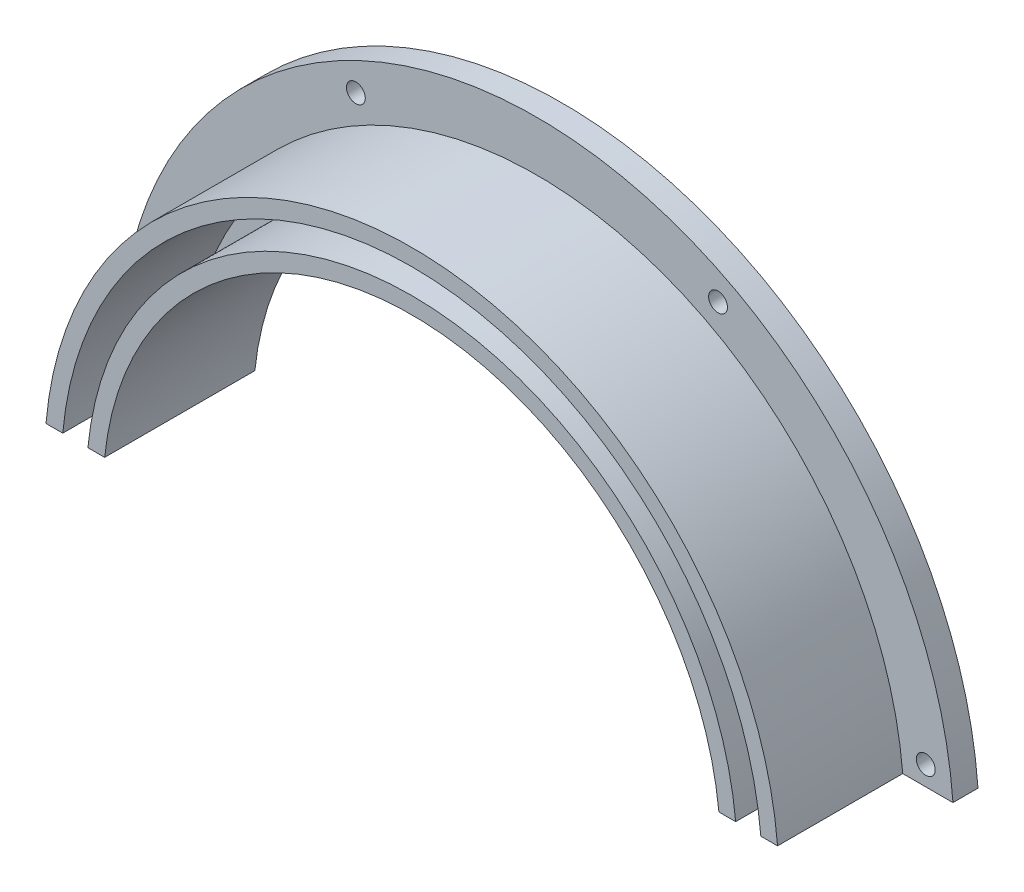
ISO-10303-21;
HEADER;
FILE_DESCRIPTION(('STEP AP214'),'2;1');
FILE_NAME('part.step','',(''),(''),'','','');
FILE_SCHEMA(('AUTOMOTIVE_DESIGN { 1 0 10303 214 1 1 1 1 }'));
ENDSEC;
DATA;
#1=APPLICATION_CONTEXT('core data for automotive mechanical design processes');
#2=APPLICATION_PROTOCOL_DEFINITION('international standard','automotive_design',2000,#1);
#3=PRODUCT_CONTEXT('',#1,'mechanical');
#4=PRODUCT('Part','Part','',(#3));
#5=PRODUCT_RELATED_PRODUCT_CATEGORY('part','',(#4));
#6=PRODUCT_DEFINITION_FORMATION('','',#4);
#7=PRODUCT_DEFINITION_CONTEXT('part definition',#1,'design');
#8=PRODUCT_DEFINITION('design','',#6,#7);
#9=PRODUCT_DEFINITION_SHAPE('','',#8);
#10=(LENGTH_UNIT() NAMED_UNIT(*) SI_UNIT(.MILLI.,.METRE.));
#11=(NAMED_UNIT(*) PLANE_ANGLE_UNIT() SI_UNIT($,.RADIAN.));
#12=(NAMED_UNIT(*) SI_UNIT($,.STERADIAN.) SOLID_ANGLE_UNIT());
#13=UNCERTAINTY_MEASURE_WITH_UNIT(LENGTH_MEASURE(1.E-05),#10,'distance_accuracy_value','');
#14=(GEOMETRIC_REPRESENTATION_CONTEXT(3) GLOBAL_UNCERTAINTY_ASSIGNED_CONTEXT((#13)) GLOBAL_UNIT_ASSIGNED_CONTEXT((#10,
#11,#12)) REPRESENTATION_CONTEXT('',''));
#15=CARTESIAN_POINT('',(0.,0.,0.));
#16=DIRECTION('',(0.,0.,1.));
#17=DIRECTION('',(1.,0.,0.));
#18=AXIS2_PLACEMENT_3D('',#15,#16,#17);
#19=CARTESIAN_POINT('',(-50.,-1.74574066942157E-13,0.));
#20=DIRECTION('',(0.,0.,-1.));
#21=DIRECTION('',(0.,1.,0.));
#22=AXIS2_PLACEMENT_3D('',#19,#20,#21);
#23=PLANE('',#22);
#24=CARTESIAN_POINT('',(-46.5979084845691,6.13473103434212,0.));
#25=DIRECTION('',(0.,0.,-1.));
#26=DIRECTION('',(0.,1.,0.));
#27=AXIS2_PLACEMENT_3D('',#24,#25,#26);
#28=CIRCLE('',#27,2.0574);
#29=CARTESIAN_POINT('',(-46.5979084845691,8.19213103434212,0.));
#30=VERTEX_POINT('',#29);
#31=EDGE_CURVE('E308',#30,#30,#28,.T.);
#32=ORIENTED_EDGE('',*,*,#31,.F.);
#33=EDGE_LOOP('',(#32));
#34=FACE_BOUND('',#33,.T.);
#35=CARTESIAN_POINT('',(-21.7021848220468,41.6895091593763,0.));
#36=DIRECTION('',(0.,0.,-1.));
#37=DIRECTION('',(0.,1.,0.));
#38=AXIS2_PLACEMENT_3D('',#35,#36,#37);
#39=CIRCLE('',#38,2.0574);
#40=CARTESIAN_POINT('',(-21.7021848220468,43.7469091593763,0.));
#41=VERTEX_POINT('',#40);
#42=EDGE_CURVE('E178',#41,#41,#39,.T.);
#43=ORIENTED_EDGE('',*,*,#42,.F.);
#44=EDGE_LOOP('',(#43));
#45=FACE_BOUND('',#44,.T.);
#46=CARTESIAN_POINT('',(21.7021848220465,41.6895091593765,0.));
#47=DIRECTION('',(0.,0.,-1.));
#48=DIRECTION('',(0.,1.,0.));
#49=AXIS2_PLACEMENT_3D('',#46,#47,#48);
#50=CIRCLE('',#49,2.0574);
#51=CARTESIAN_POINT('',(21.7021848220465,43.7469091593765,0.));
#52=VERTEX_POINT('',#51);
#53=EDGE_CURVE('E171',#52,#52,#50,.T.);
#54=ORIENTED_EDGE('',*,*,#53,.F.);
#55=EDGE_LOOP('',(#54));
#56=FACE_BOUND('',#55,.T.);
#57=CARTESIAN_POINT('',(46.5979084845691,6.13473103434243,0.));
#58=DIRECTION('',(0.,0.,-1.));
#59=DIRECTION('',(0.,1.,0.));
#60=AXIS2_PLACEMENT_3D('',#57,#58,#59);
#61=CIRCLE('',#60,2.0574);
#62=CARTESIAN_POINT('',(46.5979084845691,8.19213103434243,0.));
#63=VERTEX_POINT('',#62);
#64=EDGE_CURVE('E167',#63,#63,#61,.T.);
#65=ORIENTED_EDGE('',*,*,#64,.F.);
#66=EDGE_LOOP('',(#65));
#67=FACE_BOUND('',#66,.T.);
#68=DIRECTION('',(1.,0.,0.));
#69=VECTOR('',#68,1.);
#70=CARTESIAN_POINT('',(81.0364783019644,3.79999999999997,0.));
#71=LINE('',#70,#69);
#72=CARTESIAN_POINT('',(-49.85539088203,3.8,0.));
#73=VERTEX_POINT('',#72);
#74=CARTESIAN_POINT('',(-36.804347569275,3.79999999999999,0.));
#75=VERTEX_POINT('',#74);
#76=EDGE_CURVE('E115',#73,#75,#71,.T.);
#77=ORIENTED_EDGE('',*,*,#76,.F.);
#78=CARTESIAN_POINT('',(0.,0.,0.));
#79=DIRECTION('',(0.,0.,-1.));
#80=DIRECTION('',(0.,1.,0.));
#81=AXIS2_PLACEMENT_3D('',#78,#79,#80);
#82=CIRCLE('',#81,50.);
#83=CARTESIAN_POINT('',(49.85539088203,3.79999999999998,0.));
#84=VERTEX_POINT('',#83);
#85=EDGE_CURVE('E126',#73,#84,#82,.T.);
#86=ORIENTED_EDGE('',*,*,#85,.T.);
#87=CARTESIAN_POINT('',(36.804347569275,3.79999999999998,0.));
#88=VERTEX_POINT('',#87);
#89=EDGE_CURVE('E54',#88,#84,#71,.T.);
#90=ORIENTED_EDGE('',*,*,#89,.F.);
#91=CARTESIAN_POINT('',(0.,0.,0.));
#92=DIRECTION('',(0.,0.,-1.));
#93=DIRECTION('',(0.,1.,0.));
#94=AXIS2_PLACEMENT_3D('',#91,#92,#93);
#95=CIRCLE('',#94,37.);
#96=EDGE_CURVE('E121',#75,#88,#95,.T.);
#97=ORIENTED_EDGE('',*,*,#96,.F.);
#98=EDGE_LOOP('',(#77,#86,#90,#97));
#99=FACE_BOUND('',#98,.T.);
#100=ADVANCED_FACE('F38',(#34,#45,#56,#67,#99),#23,.T.);
#101=CARTESIAN_POINT('',(0.,0.,0.));
#102=DIRECTION('',(0.,0.,-1.));
#103=DIRECTION('',(0.,1.,0.));
#104=AXIS2_PLACEMENT_3D('',#101,#102,#103);
#105=CYLINDRICAL_SURFACE('',#104,37.);
#106=DIRECTION('',(0.,0.,-1.));
#107=VECTOR('',#106,1.);
#108=CARTESIAN_POINT('',(36.804347569275,3.79999999999998,0.));
#109=LINE('',#108,#107);
#110=CARTESIAN_POINT('',(36.804347569275,3.79999999999998,18.));
#111=VERTEX_POINT('',#110);
#112=EDGE_CURVE('E132',#111,#88,#109,.T.);
#113=ORIENTED_EDGE('',*,*,#112,.F.);
#114=CARTESIAN_POINT('',(0.,0.,18.));
#115=DIRECTION('',(0.,0.,-1.));
#116=DIRECTION('',(0.,1.,0.));
#117=AXIS2_PLACEMENT_3D('',#114,#115,#116);
#118=CIRCLE('',#117,37.);
#119=CARTESIAN_POINT('',(-36.804347569275,3.79999999999999,18.));
#120=VERTEX_POINT('',#119);
#121=EDGE_CURVE('E157',#120,#111,#118,.T.);
#122=ORIENTED_EDGE('',*,*,#121,.F.);
#123=DIRECTION('',(0.,0.,-1.));
#124=VECTOR('',#123,1.);
#125=CARTESIAN_POINT('',(-36.804347569275,3.79999999999999,0.));
#126=LINE('',#125,#124);
#127=EDGE_CURVE('E136',#75,#120,#126,.F.);
#128=ORIENTED_EDGE('',*,*,#127,.F.);
#129=ORIENTED_EDGE('',*,*,#96,.T.);
#130=EDGE_LOOP('',(#113,#122,#128,#129));
#131=FACE_BOUND('',#130,.T.);
#132=ADVANCED_FACE('F40',(#131),#105,.F.);
#133=CARTESIAN_POINT('',(-37.,-1.31389173775661E-13,18.));
#134=DIRECTION('',(0.,0.,1.));
#135=DIRECTION('',(0.,-1.,0.));
#136=AXIS2_PLACEMENT_3D('',#133,#134,#135);
#137=PLANE('',#136);
#138=DIRECTION('',(1.,0.,0.));
#139=VECTOR('',#138,1.);
#140=CARTESIAN_POINT('',(81.0364783019644,3.79999999999997,18.));
#141=LINE('',#140,#139);
#142=CARTESIAN_POINT('',(38.8144303062662,3.79999999999998,18.));
#143=VERTEX_POINT('',#142);
#144=EDGE_CURVE('E193',#111,#143,#141,.T.);
#145=ORIENTED_EDGE('',*,*,#144,.T.);
#146=CARTESIAN_POINT('',(0.,0.,18.));
#147=DIRECTION('',(0.,0.,-1.));
#148=DIRECTION('',(0.,1.,0.));
#149=AXIS2_PLACEMENT_3D('',#146,#147,#148);
#150=CIRCLE('',#149,39.);
#151=CARTESIAN_POINT('',(-38.8144303062662,3.79999999999999,18.));
#152=VERTEX_POINT('',#151);
#153=EDGE_CURVE('E154',#152,#143,#150,.T.);
#154=ORIENTED_EDGE('',*,*,#153,.F.);
#155=EDGE_CURVE('E213',#152,#120,#141,.T.);
#156=ORIENTED_EDGE('',*,*,#155,.T.);
#157=ORIENTED_EDGE('',*,*,#121,.T.);
#158=EDGE_LOOP('',(#145,#154,#156,#157));
#159=FACE_BOUND('',#158,.T.);
#160=ADVANCED_FACE('F220',(#159),#137,.T.);
#161=CARTESIAN_POINT('',(0.,0.,0.));
#162=DIRECTION('',(0.,0.,-1.));
#163=DIRECTION('',(0.,1.,0.));
#164=AXIS2_PLACEMENT_3D('',#161,#162,#163);
#165=CYLINDRICAL_SURFACE('',#164,39.);
#166=DIRECTION('',(0.,0.,-1.));
#167=VECTOR('',#166,1.);
#168=CARTESIAN_POINT('',(38.8144303062662,3.79999999999998,0.));
#169=LINE('',#168,#167);
#170=CARTESIAN_POINT('',(38.8144303062662,3.79999999999998,3.));
#171=VERTEX_POINT('',#170);
#172=EDGE_CURVE('E211',#171,#143,#169,.F.);
#173=ORIENTED_EDGE('',*,*,#172,.F.);
#174=CARTESIAN_POINT('',(0.,0.,3.));
#175=DIRECTION('',(0.,0.,-1.));
#176=DIRECTION('',(0.,1.,0.));
#177=AXIS2_PLACEMENT_3D('',#174,#175,#176);
#178=CIRCLE('',#177,39.);
#179=CARTESIAN_POINT('',(-38.8144303062662,3.79999999999999,3.));
#180=VERTEX_POINT('',#179);
#181=EDGE_CURVE('E151',#180,#171,#178,.T.);
#182=ORIENTED_EDGE('',*,*,#181,.F.);
#183=DIRECTION('',(0.,0.,-1.));
#184=VECTOR('',#183,1.);
#185=CARTESIAN_POINT('',(-38.8144303062662,3.79999999999999,0.));
#186=LINE('',#185,#184);
#187=EDGE_CURVE('E206',#152,#180,#186,.T.);
#188=ORIENTED_EDGE('',*,*,#187,.F.);
#189=ORIENTED_EDGE('',*,*,#153,.T.);
#190=EDGE_LOOP('',(#173,#182,#188,#189));
#191=FACE_BOUND('',#190,.T.);
#192=ADVANCED_FACE('F225',(#191),#165,.T.);
#193=CARTESIAN_POINT('',(-39.,-1.36535166254626E-13,3.));
#194=DIRECTION('',(0.,0.,1.));
#195=DIRECTION('',(0.,-1.,0.));
#196=AXIS2_PLACEMENT_3D('',#193,#194,#195);
#197=PLANE('',#196);
#198=DIRECTION('',(-1.,0.,0.));
#199=VECTOR('',#198,1.);
#200=CARTESIAN_POINT('',(-39.,3.79999999999999,3.));
#201=LINE('',#200,#199);
#202=CARTESIAN_POINT('',(41.8277419902151,3.79999999999998,3.));
#203=VERTEX_POINT('',#202);
#204=EDGE_CURVE('E207',#203,#171,#201,.T.);
#205=ORIENTED_EDGE('',*,*,#204,.F.);
#206=CARTESIAN_POINT('',(0.,0.,3.));
#207=DIRECTION('',(0.,0.,-1.));
#208=DIRECTION('',(0.,1.,0.));
#209=AXIS2_PLACEMENT_3D('',#206,#207,#208);
#210=CIRCLE('',#209,42.);
#211=CARTESIAN_POINT('',(-41.8277419902151,3.79999999999999,3.));
#212=VERTEX_POINT('',#211);
#213=EDGE_CURVE('E148',#212,#203,#210,.T.);
#214=ORIENTED_EDGE('',*,*,#213,.F.);
#215=EDGE_CURVE('E204',#180,#212,#201,.T.);
#216=ORIENTED_EDGE('',*,*,#215,.F.);
#217=ORIENTED_EDGE('',*,*,#181,.T.);
#218=EDGE_LOOP('',(#205,#214,#216,#217));
#219=FACE_BOUND('',#218,.T.);
#220=ADVANCED_FACE('F232',(#219),#197,.T.);
#221=CARTESIAN_POINT('',(0.,0.,0.));
#222=DIRECTION('',(0.,0.,-1.));
#223=DIRECTION('',(0.,1.,0.));
#224=AXIS2_PLACEMENT_3D('',#221,#222,#223);
#225=CYLINDRICAL_SURFACE('',#224,42.);
#226=DIRECTION('',(0.,0.,-1.));
#227=VECTOR('',#226,1.);
#228=CARTESIAN_POINT('',(41.8277419902151,3.79999999999998,0.));
#229=LINE('',#228,#227);
#230=CARTESIAN_POINT('',(41.8277419902151,3.79999999999998,18.));
#231=VERTEX_POINT('',#230);
#232=EDGE_CURVE('E209',#231,#203,#229,.T.);
#233=ORIENTED_EDGE('',*,*,#232,.F.);
#234=CARTESIAN_POINT('',(0.,0.,18.));
#235=DIRECTION('',(0.,0.,-1.));
#236=DIRECTION('',(0.,1.,0.));
#237=AXIS2_PLACEMENT_3D('',#234,#235,#236);
#238=CIRCLE('',#237,42.);
#239=CARTESIAN_POINT('',(-41.8277419902151,3.79999999999999,18.));
#240=VERTEX_POINT('',#239);
#241=EDGE_CURVE('E145',#240,#231,#238,.T.);
#242=ORIENTED_EDGE('',*,*,#241,.F.);
#243=DIRECTION('',(0.,0.,-1.));
#244=VECTOR('',#243,1.);
#245=CARTESIAN_POINT('',(-41.8277419902151,3.79999999999999,0.));
#246=LINE('',#245,#244);
#247=EDGE_CURVE('E202',#212,#240,#246,.F.);
#248=ORIENTED_EDGE('',*,*,#247,.F.);
#249=ORIENTED_EDGE('',*,*,#213,.T.);
#250=EDGE_LOOP('',(#233,#242,#248,#249));
#251=FACE_BOUND('',#250,.T.);
#252=ADVANCED_FACE('F235',(#251),#225,.F.);
#253=CARTESIAN_POINT('',(-42.,-1.48846580469877E-13,18.));
#254=DIRECTION('',(0.,0.,1.));
#255=DIRECTION('',(0.,-1.,0.));
#256=AXIS2_PLACEMENT_3D('',#253,#254,#255);
#257=PLANE('',#256);
#258=CARTESIAN_POINT('',(43.8356019691757,3.79999999999998,18.));
#259=VERTEX_POINT('',#258);
#260=EDGE_CURVE('E128',#231,#259,#141,.T.);
#261=ORIENTED_EDGE('',*,*,#260,.T.);
#262=CARTESIAN_POINT('',(0.,0.,18.));
#263=DIRECTION('',(0.,0.,-1.));
#264=DIRECTION('',(0.,1.,0.));
#265=AXIS2_PLACEMENT_3D('',#262,#263,#264);
#266=CIRCLE('',#265,44.);
#267=CARTESIAN_POINT('',(-43.8356019691757,3.79999999999999,18.));
#268=VERTEX_POINT('',#267);
#269=EDGE_CURVE('E142',#268,#259,#266,.T.);
#270=ORIENTED_EDGE('',*,*,#269,.F.);
#271=EDGE_CURVE('E194',#268,#240,#141,.T.);
#272=ORIENTED_EDGE('',*,*,#271,.T.);
#273=ORIENTED_EDGE('',*,*,#241,.T.);
#274=EDGE_LOOP('',(#261,#270,#272,#273));
#275=FACE_BOUND('',#274,.T.);
#276=ADVANCED_FACE('F241',(#275),#257,.T.);
#277=CARTESIAN_POINT('',(0.,0.,0.));
#278=DIRECTION('',(0.,0.,-1.));
#279=DIRECTION('',(0.,1.,0.));
#280=AXIS2_PLACEMENT_3D('',#277,#278,#279);
#281=CYLINDRICAL_SURFACE('',#280,44.);
#282=DIRECTION('',(0.,0.,-1.));
#283=VECTOR('',#282,1.);
#284=CARTESIAN_POINT('',(43.8356019691757,3.79999999999998,0.));
#285=LINE('',#284,#283);
#286=CARTESIAN_POINT('',(43.8356019691757,3.79999999999998,3.));
#287=VERTEX_POINT('',#286);
#288=EDGE_CURVE('E200',#287,#259,#285,.F.);
#289=ORIENTED_EDGE('',*,*,#288,.F.);
#290=CARTESIAN_POINT('',(0.,0.,3.));
#291=DIRECTION('',(0.,0.,-1.));
#292=DIRECTION('',(0.,1.,0.));
#293=AXIS2_PLACEMENT_3D('',#290,#291,#292);
#294=CIRCLE('',#293,44.);
#295=CARTESIAN_POINT('',(-43.8356019691757,3.79999999999999,3.));
#296=VERTEX_POINT('',#295);
#297=EDGE_CURVE('E134',#296,#287,#294,.T.);
#298=ORIENTED_EDGE('',*,*,#297,.F.);
#299=DIRECTION('',(0.,0.,-1.));
#300=VECTOR('',#299,1.);
#301=CARTESIAN_POINT('',(-43.8356019691757,3.79999999999999,0.));
#302=LINE('',#301,#300);
#303=EDGE_CURVE('E197',#268,#296,#302,.T.);
#304=ORIENTED_EDGE('',*,*,#303,.F.);
#305=ORIENTED_EDGE('',*,*,#269,.T.);
#306=EDGE_LOOP('',(#289,#298,#304,#305));
#307=FACE_BOUND('',#306,.T.);
#308=ADVANCED_FACE('F244',(#307),#281,.T.);
#309=CARTESIAN_POINT('',(-44.,-1.53992572948842E-13,3.));
#310=DIRECTION('',(0.,0.,1.));
#311=DIRECTION('',(0.,-1.,0.));
#312=AXIS2_PLACEMENT_3D('',#309,#310,#311);
#313=PLANE('',#312);
#314=CARTESIAN_POINT('',(-46.5979084845691,6.13473103434212,3.));
#315=DIRECTION('',(0.,0.,1.));
#316=DIRECTION('',(0.,-1.,0.));
#317=AXIS2_PLACEMENT_3D('',#314,#315,#316);
#318=CIRCLE('',#317,1.1303);
#319=CARTESIAN_POINT('',(-46.5979084845691,5.00443103434212,3.));
#320=VERTEX_POINT('',#319);
#321=EDGE_CURVE('E42',#320,#320,#318,.T.);
#322=ORIENTED_EDGE('',*,*,#321,.F.);
#323=EDGE_LOOP('',(#322));
#324=FACE_BOUND('',#323,.T.);
#325=CARTESIAN_POINT('',(-21.7021848220468,41.6895091593763,3.00000000000001));
#326=DIRECTION('',(0.,0.,1.));
#327=DIRECTION('',(0.,-1.,0.));
#328=AXIS2_PLACEMENT_3D('',#325,#326,#327);
#329=CIRCLE('',#328,1.1303);
#330=CARTESIAN_POINT('',(-21.7021848220468,40.5592091593763,3.00000000000001));
#331=VERTEX_POINT('',#330);
#332=EDGE_CURVE('E169',#331,#331,#329,.T.);
#333=ORIENTED_EDGE('',*,*,#332,.F.);
#334=EDGE_LOOP('',(#333));
#335=FACE_BOUND('',#334,.T.);
#336=CARTESIAN_POINT('',(21.7021848220465,41.6895091593765,3.00000000000001));
#337=DIRECTION('',(0.,0.,1.));
#338=DIRECTION('',(0.,-1.,0.));
#339=AXIS2_PLACEMENT_3D('',#336,#337,#338);
#340=CIRCLE('',#339,1.1303);
#341=CARTESIAN_POINT('',(21.7021848220465,40.5592091593765,3.00000000000001));
#342=VERTEX_POINT('',#341);
#343=EDGE_CURVE('E165',#342,#342,#340,.T.);
#344=ORIENTED_EDGE('',*,*,#343,.F.);
#345=EDGE_LOOP('',(#344));
#346=FACE_BOUND('',#345,.T.);
#347=CARTESIAN_POINT('',(46.5979084845691,6.13473103434243,3.));
#348=DIRECTION('',(0.,0.,1.));
#349=DIRECTION('',(0.,-1.,0.));
#350=AXIS2_PLACEMENT_3D('',#347,#348,#349);
#351=CIRCLE('',#350,1.1303);
#352=CARTESIAN_POINT('',(46.5979084845691,5.00443103434244,3.));
#353=VERTEX_POINT('',#352);
#354=EDGE_CURVE('E161',#353,#353,#351,.T.);
#355=ORIENTED_EDGE('',*,*,#354,.F.);
#356=EDGE_LOOP('',(#355));
#357=FACE_BOUND('',#356,.T.);
#358=DIRECTION('',(-1.,0.,0.));
#359=VECTOR('',#358,1.);
#360=CARTESIAN_POINT('',(-44.,3.79999999999999,3.));
#361=LINE('',#360,#359);
#362=CARTESIAN_POINT('',(49.85539088203,3.79999999999998,3.));
#363=VERTEX_POINT('',#362);
#364=EDGE_CURVE('E198',#363,#287,#361,.T.);
#365=ORIENTED_EDGE('',*,*,#364,.F.);
#366=CARTESIAN_POINT('',(0.,0.,3.));
#367=DIRECTION('',(0.,0.,-1.));
#368=DIRECTION('',(0.,1.,0.));
#369=AXIS2_PLACEMENT_3D('',#366,#367,#368);
#370=CIRCLE('',#369,50.);
#371=CARTESIAN_POINT('',(-49.85539088203,3.79999999999999,3.));
#372=VERTEX_POINT('',#371);
#373=EDGE_CURVE('E131',#372,#363,#370,.T.);
#374=ORIENTED_EDGE('',*,*,#373,.F.);
#375=EDGE_CURVE('E62',#296,#372,#361,.T.);
#376=ORIENTED_EDGE('',*,*,#375,.F.);
#377=ORIENTED_EDGE('',*,*,#297,.T.);
#378=EDGE_LOOP('',(#365,#374,#376,#377));
#379=FACE_BOUND('',#378,.T.);
#380=ADVANCED_FACE('F248',(#324,#335,#346,#357,#379),#313,.T.);
#381=CARTESIAN_POINT('',(0.,0.,0.));
#382=DIRECTION('',(0.,0.,-1.));
#383=DIRECTION('',(0.,1.,0.));
#384=AXIS2_PLACEMENT_3D('',#381,#382,#383);
#385=CYLINDRICAL_SURFACE('',#384,50.);
#386=DIRECTION('',(0.,0.,-1.));
#387=VECTOR('',#386,1.);
#388=CARTESIAN_POINT('',(49.85539088203,3.79999999999998,0.));
#389=LINE('',#388,#387);
#390=EDGE_CURVE('E11',#84,#363,#389,.F.);
#391=ORIENTED_EDGE('',*,*,#390,.F.);
#392=ORIENTED_EDGE('',*,*,#85,.F.);
#393=DIRECTION('',(0.,0.,-1.));
#394=VECTOR('',#393,1.);
#395=CARTESIAN_POINT('',(-49.85539088203,3.8,0.));
#396=LINE('',#395,#394);
#397=EDGE_CURVE('E47',#372,#73,#396,.T.);
#398=ORIENTED_EDGE('',*,*,#397,.F.);
#399=ORIENTED_EDGE('',*,*,#373,.T.);
#400=EDGE_LOOP('',(#391,#392,#398,#399));
#401=FACE_BOUND('',#400,.T.);
#402=ADVANCED_FACE('F130',(#401),#385,.T.);
#403=CARTESIAN_POINT('',(81.0364783019644,3.79999999999997,18.));
#404=DIRECTION('',(0.,1.,0.));
#405=DIRECTION('',(-1.,0.,0.));
#406=AXIS2_PLACEMENT_3D('',#403,#404,#405);
#407=PLANE('',#406);
#408=ORIENTED_EDGE('',*,*,#127,.T.);
#409=ORIENTED_EDGE('',*,*,#155,.F.);
#410=ORIENTED_EDGE('',*,*,#187,.T.);
#411=ORIENTED_EDGE('',*,*,#215,.T.);
#412=ORIENTED_EDGE('',*,*,#247,.T.);
#413=ORIENTED_EDGE('',*,*,#271,.F.);
#414=ORIENTED_EDGE('',*,*,#303,.T.);
#415=ORIENTED_EDGE('',*,*,#375,.T.);
#416=ORIENTED_EDGE('',*,*,#397,.T.);
#417=ORIENTED_EDGE('',*,*,#76,.T.);
#418=EDGE_LOOP('',(#408,#409,#410,#411,#412,#413,#414,#415,#416,#417));
#419=FACE_BOUND('',#418,.T.);
#420=ADVANCED_FACE('F114',(#419),#407,.F.);
#421=ORIENTED_EDGE('',*,*,#112,.T.);
#422=ORIENTED_EDGE('',*,*,#89,.T.);
#423=ORIENTED_EDGE('',*,*,#390,.T.);
#424=ORIENTED_EDGE('',*,*,#364,.T.);
#425=ORIENTED_EDGE('',*,*,#288,.T.);
#426=ORIENTED_EDGE('',*,*,#260,.F.);
#427=ORIENTED_EDGE('',*,*,#232,.T.);
#428=ORIENTED_EDGE('',*,*,#204,.T.);
#429=ORIENTED_EDGE('',*,*,#172,.T.);
#430=ORIENTED_EDGE('',*,*,#144,.F.);
#431=EDGE_LOOP('',(#421,#422,#423,#424,#425,#426,#427,#428,#429,#430));
#432=FACE_BOUND('',#431,.T.);
#433=ADVANCED_FACE('F222',(#432),#407,.F.);
#434=CARTESIAN_POINT('',(46.5979084845691,6.13473103434243,0.));
#435=DIRECTION('',(0.,0.,-1.));
#436=DIRECTION('',(0.,1.,0.));
#437=AXIS2_PLACEMENT_3D('',#434,#435,#436);
#438=CYLINDRICAL_SURFACE('',#437,1.1303);
#439=ORIENTED_EDGE('',*,*,#354,.T.);
#440=EDGE_LOOP('',(#439));
#441=FACE_BOUND('',#440,.T.);
#442=CARTESIAN_POINT('',(46.5979084845691,6.13473103434243,0.927100000000001));
#443=DIRECTION('',(0.,0.,-1.));
#444=DIRECTION('',(0.,1.,0.));
#445=AXIS2_PLACEMENT_3D('',#442,#443,#444);
#446=CIRCLE('',#445,1.1303);
#447=CARTESIAN_POINT('',(46.5979084845691,7.26503103434243,0.927100000000001));
#448=VERTEX_POINT('',#447);
#449=EDGE_CURVE('E164',#448,#448,#446,.T.);
#450=ORIENTED_EDGE('',*,*,#449,.T.);
#451=EDGE_LOOP('',(#450));
#452=FACE_BOUND('',#451,.T.);
#453=ADVANCED_FACE('F271',(#441,#452),#438,.F.);
#454=CARTESIAN_POINT('',(46.5979084845691,6.13473103434243,0.));
#455=DIRECTION('',(0.,0.,-1.));
#456=DIRECTION('',(0.,1.,0.));
#457=AXIS2_PLACEMENT_3D('',#454,#455,#456);
#458=CONICAL_SURFACE('',#457,2.0574,0.785398163397448);
#459=ORIENTED_EDGE('',*,*,#449,.F.);
#460=EDGE_LOOP('',(#459));
#461=FACE_BOUND('',#460,.T.);
#462=ORIENTED_EDGE('',*,*,#64,.T.);
#463=EDGE_LOOP('',(#462));
#464=FACE_BOUND('',#463,.T.);
#465=ADVANCED_FACE('F274',(#461,#464),#458,.F.);
#466=CARTESIAN_POINT('',(21.7021848220465,41.6895091593765,0.));
#467=DIRECTION('',(0.,0.,-1.));
#468=DIRECTION('',(0.,1.,0.));
#469=AXIS2_PLACEMENT_3D('',#466,#467,#468);
#470=CYLINDRICAL_SURFACE('',#469,1.1303);
#471=ORIENTED_EDGE('',*,*,#343,.T.);
#472=EDGE_LOOP('',(#471));
#473=FACE_BOUND('',#472,.T.);
#474=CARTESIAN_POINT('',(21.7021848220465,41.6895091593765,0.927100000000005));
#475=DIRECTION('',(0.,0.,-1.));
#476=DIRECTION('',(0.,1.,0.));
#477=AXIS2_PLACEMENT_3D('',#474,#475,#476);
#478=CIRCLE('',#477,1.1303);
#479=CARTESIAN_POINT('',(21.7021848220465,42.8198091593765,0.927100000000005));
#480=VERTEX_POINT('',#479);
#481=EDGE_CURVE('E168',#480,#480,#478,.T.);
#482=ORIENTED_EDGE('',*,*,#481,.T.);
#483=EDGE_LOOP('',(#482));
#484=FACE_BOUND('',#483,.T.);
#485=ADVANCED_FACE('F278',(#473,#484),#470,.F.);
#486=CARTESIAN_POINT('',(21.7021848220465,41.6895091593765,0.));
#487=DIRECTION('',(0.,0.,-1.));
#488=DIRECTION('',(0.,1.,0.));
#489=AXIS2_PLACEMENT_3D('',#486,#487,#488);
#490=CONICAL_SURFACE('',#489,2.0574,0.78539816339745);
#491=ORIENTED_EDGE('',*,*,#481,.F.);
#492=EDGE_LOOP('',(#491));
#493=FACE_BOUND('',#492,.T.);
#494=ORIENTED_EDGE('',*,*,#53,.T.);
#495=EDGE_LOOP('',(#494));
#496=FACE_BOUND('',#495,.T.);
#497=ADVANCED_FACE('F282',(#493,#496),#490,.F.);
#498=CARTESIAN_POINT('',(-21.7021848220468,41.6895091593763,0.));
#499=DIRECTION('',(0.,0.,-1.));
#500=DIRECTION('',(0.,1.,0.));
#501=AXIS2_PLACEMENT_3D('',#498,#499,#500);
#502=CYLINDRICAL_SURFACE('',#501,1.1303);
#503=ORIENTED_EDGE('',*,*,#332,.T.);
#504=EDGE_LOOP('',(#503));
#505=FACE_BOUND('',#504,.T.);
#506=CARTESIAN_POINT('',(-21.7021848220468,41.6895091593763,0.927100000000005));
#507=DIRECTION('',(0.,0.,-1.));
#508=DIRECTION('',(0.,1.,0.));
#509=AXIS2_PLACEMENT_3D('',#506,#507,#508);
#510=CIRCLE('',#509,1.1303);
#511=CARTESIAN_POINT('',(-21.7021848220468,42.8198091593763,0.927100000000005));
#512=VERTEX_POINT('',#511);
#513=EDGE_CURVE('E172',#512,#512,#510,.T.);
#514=ORIENTED_EDGE('',*,*,#513,.T.);
#515=EDGE_LOOP('',(#514));
#516=FACE_BOUND('',#515,.T.);
#517=ADVANCED_FACE('F286',(#505,#516),#502,.F.);
#518=CARTESIAN_POINT('',(-21.7021848220468,41.6895091593763,0.));
#519=DIRECTION('',(0.,0.,-1.));
#520=DIRECTION('',(0.,1.,0.));
#521=AXIS2_PLACEMENT_3D('',#518,#519,#520);
#522=CONICAL_SURFACE('',#521,2.0574,0.78539816339745);
#523=ORIENTED_EDGE('',*,*,#513,.F.);
#524=EDGE_LOOP('',(#523));
#525=FACE_BOUND('',#524,.T.);
#526=ORIENTED_EDGE('',*,*,#42,.T.);
#527=EDGE_LOOP('',(#526));
#528=FACE_BOUND('',#527,.T.);
#529=ADVANCED_FACE('F290',(#525,#528),#522,.F.);
#530=CARTESIAN_POINT('',(-46.5979084845691,6.13473103434212,0.));
#531=DIRECTION('',(0.,0.,-1.));
#532=DIRECTION('',(0.,1.,0.));
#533=AXIS2_PLACEMENT_3D('',#530,#531,#532);
#534=CYLINDRICAL_SURFACE('',#533,1.1303);
#535=ORIENTED_EDGE('',*,*,#321,.T.);
#536=EDGE_LOOP('',(#535));
#537=FACE_BOUND('',#536,.T.);
#538=CARTESIAN_POINT('',(-46.5979084845691,6.13473103434212,0.927100000000001));
#539=DIRECTION('',(0.,0.,-1.));
#540=DIRECTION('',(0.,1.,0.));
#541=AXIS2_PLACEMENT_3D('',#538,#539,#540);
#542=CIRCLE('',#541,1.1303);
#543=CARTESIAN_POINT('',(-46.5979084845691,7.26503103434212,0.927100000000001));
#544=VERTEX_POINT('',#543);
#545=EDGE_CURVE('E306',#544,#544,#542,.T.);
#546=ORIENTED_EDGE('',*,*,#545,.T.);
#547=EDGE_LOOP('',(#546));
#548=FACE_BOUND('',#547,.T.);
#549=ADVANCED_FACE('F293',(#537,#548),#534,.F.);
#550=CARTESIAN_POINT('',(-46.5979084845691,6.13473103434212,0.));
#551=DIRECTION('',(0.,0.,-1.));
#552=DIRECTION('',(0.,1.,0.));
#553=AXIS2_PLACEMENT_3D('',#550,#551,#552);
#554=CONICAL_SURFACE('',#553,2.0574,0.785398163397448);
#555=ORIENTED_EDGE('',*,*,#545,.F.);
#556=EDGE_LOOP('',(#555));
#557=FACE_BOUND('',#556,.T.);
#558=ORIENTED_EDGE('',*,*,#31,.T.);
#559=EDGE_LOOP('',(#558));
#560=FACE_BOUND('',#559,.T.);
#561=ADVANCED_FACE('F297',(#557,#560),#554,.F.);
#562=CLOSED_SHELL('',(#100,#132,#160,#192,#220,#252,#276,#308,#380,#402,#420,#433,#453,#465,
#485,#497,#517,#529,#549,#561));
#563=MANIFOLD_SOLID_BREP('B2',#562);
#564=ADVANCED_BREP_SHAPE_REPRESENTATION('',(#18,#563),#14);
#565=SHAPE_DEFINITION_REPRESENTATION(#9,#564);
ENDSEC;
END-ISO-10303-21;
